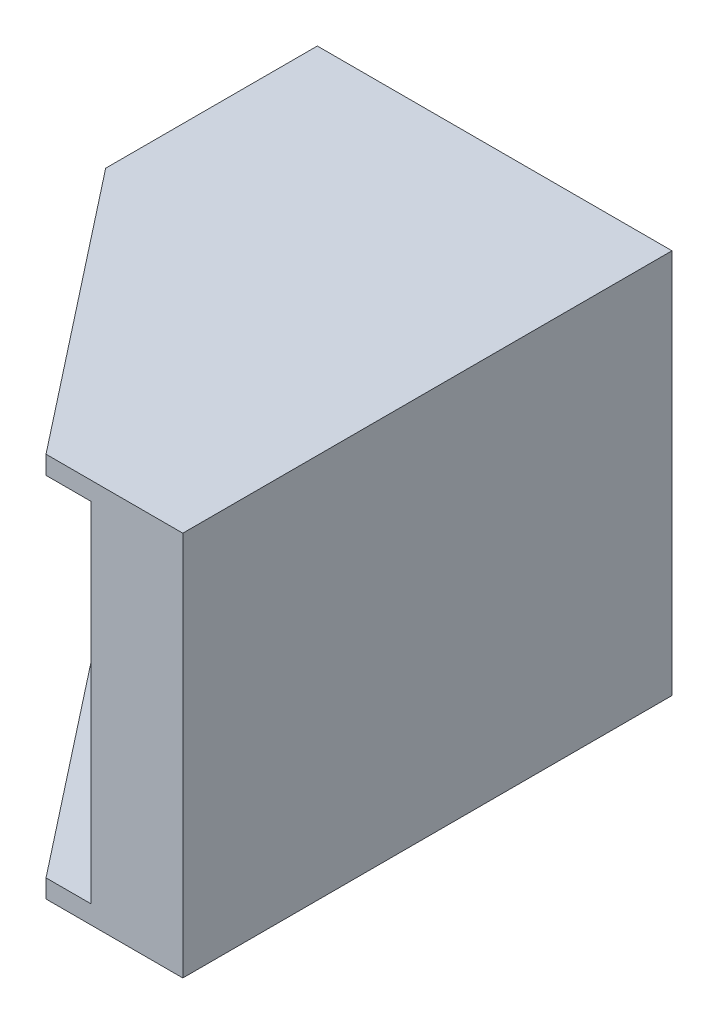
ISO-10303-21;
HEADER;
FILE_DESCRIPTION(('STEP AP214'),'2;1');
FILE_NAME('part.step','',(''),(''),'','','');
FILE_SCHEMA(('AUTOMOTIVE_DESIGN { 1 0 10303 214 1 1 1 1 }'));
ENDSEC;
DATA;
#1=APPLICATION_CONTEXT('core data for automotive mechanical design processes');
#2=APPLICATION_PROTOCOL_DEFINITION('international standard','automotive_design',2000,#1);
#3=PRODUCT_CONTEXT('',#1,'mechanical');
#4=PRODUCT('Part','Part','',(#3));
#5=PRODUCT_RELATED_PRODUCT_CATEGORY('part','',(#4));
#6=PRODUCT_DEFINITION_FORMATION('','',#4);
#7=PRODUCT_DEFINITION_CONTEXT('part definition',#1,'design');
#8=PRODUCT_DEFINITION('design','',#6,#7);
#9=PRODUCT_DEFINITION_SHAPE('','',#8);
#10=(LENGTH_UNIT() NAMED_UNIT(*) SI_UNIT(.MILLI.,.METRE.));
#11=(NAMED_UNIT(*) PLANE_ANGLE_UNIT() SI_UNIT($,.RADIAN.));
#12=(NAMED_UNIT(*) SI_UNIT($,.STERADIAN.) SOLID_ANGLE_UNIT());
#13=UNCERTAINTY_MEASURE_WITH_UNIT(LENGTH_MEASURE(1.E-05),#10,'distance_accuracy_value','');
#14=(GEOMETRIC_REPRESENTATION_CONTEXT(3) GLOBAL_UNCERTAINTY_ASSIGNED_CONTEXT((#13)) GLOBAL_UNIT_ASSIGNED_CONTEXT((#10,
#11,#12)) REPRESENTATION_CONTEXT('',''));
#15=CARTESIAN_POINT('',(0.,0.,0.));
#16=DIRECTION('',(0.,0.,1.));
#17=DIRECTION('',(1.,0.,0.));
#18=AXIS2_PLACEMENT_3D('',#15,#16,#17);
#19=CARTESIAN_POINT('',(-63.8521253201691,33.0849783461479,60.));
#20=DIRECTION('',(1.,0.,0.));
#21=DIRECTION('',(0.,0.,-1.));
#22=AXIS2_PLACEMENT_3D('',#19,#20,#21);
#23=PLANE('',#22);
#24=DIRECTION('',(0.,0.,-1.));
#25=VECTOR('',#24,1.);
#26=CARTESIAN_POINT('',(-63.8521253201691,-29.9150216538521,60.));
#27=LINE('',#26,#25);
#28=CARTESIAN_POINT('',(-63.8521253201691,-29.9150216538521,14.6149110205421));
#29=VERTEX_POINT('',#28);
#30=CARTESIAN_POINT('',(-63.8521253201691,-29.9150216538521,-20.));
#31=VERTEX_POINT('',#30);
#32=EDGE_CURVE('E51',#29,#31,#27,.T.);
#33=ORIENTED_EDGE('',*,*,#32,.F.);
#34=DIRECTION('',(0.,-1.,0.));
#35=VECTOR('',#34,1.);
#36=CARTESIAN_POINT('',(-63.8521253201691,33.0849783461479,14.6149110205421));
#37=LINE('',#36,#35);
#38=CARTESIAN_POINT('',(-63.8521253201691,-26.9150216538521,14.6149110205421));
#39=VERTEX_POINT('',#38);
#40=EDGE_CURVE('E159',#39,#29,#37,.T.);
#41=ORIENTED_EDGE('',*,*,#40,.F.);
#42=DIRECTION('',(0.,0.,1.));
#43=VECTOR('',#42,1.);
#44=CARTESIAN_POINT('',(-63.8521253201691,-26.9150216538521,4.00000000000003));
#45=LINE('',#44,#43);
#46=CARTESIAN_POINT('',(-63.8521253201691,-26.9150216538521,4.00000000000003));
#47=VERTEX_POINT('',#46);
#48=EDGE_CURVE('E189',#47,#39,#45,.T.);
#49=ORIENTED_EDGE('',*,*,#48,.F.);
#50=DIRECTION('',(0.,-1.,0.));
#51=VECTOR('',#50,1.);
#52=CARTESIAN_POINT('',(-63.8521253201691,30.0849783461479,4.00000000000003));
#53=LINE('',#52,#51);
#54=CARTESIAN_POINT('',(-63.8521253201691,30.0849783461479,4.00000000000003));
#55=VERTEX_POINT('',#54);
#56=EDGE_CURVE('E172',#55,#47,#53,.T.);
#57=ORIENTED_EDGE('',*,*,#56,.F.);
#58=DIRECTION('',(0.,0.,1.));
#59=VECTOR('',#58,1.);
#60=CARTESIAN_POINT('',(-63.8521253201691,30.0849783461479,4.00000000000003));
#61=LINE('',#60,#59);
#62=CARTESIAN_POINT('',(-63.8521253201691,30.0849783461479,14.6149110205421));
#63=VERTEX_POINT('',#62);
#64=EDGE_CURVE('E199',#55,#63,#61,.T.);
#65=ORIENTED_EDGE('',*,*,#64,.T.);
#66=CARTESIAN_POINT('',(-63.8521253201691,33.0849783461479,14.6149110205421));
#67=VERTEX_POINT('',#66);
#68=EDGE_CURVE('E58',#67,#63,#37,.T.);
#69=ORIENTED_EDGE('',*,*,#68,.F.);
#70=DIRECTION('',(0.,0.,-1.));
#71=VECTOR('',#70,1.);
#72=CARTESIAN_POINT('',(-63.8521253201691,33.0849783461479,60.));
#73=LINE('',#72,#71);
#74=CARTESIAN_POINT('',(-63.8521253201691,33.0849783461479,-20.));
#75=VERTEX_POINT('',#74);
#76=EDGE_CURVE('E222',#67,#75,#73,.T.);
#77=ORIENTED_EDGE('',*,*,#76,.T.);
#78=DIRECTION('',(0.,1.,0.));
#79=VECTOR('',#78,1.);
#80=CARTESIAN_POINT('',(-63.8521253201691,33.0849783461479,-20.));
#81=LINE('',#80,#79);
#82=EDGE_CURVE('E141',#31,#75,#81,.T.);
#83=ORIENTED_EDGE('',*,*,#82,.F.);
#84=EDGE_LOOP('',(#33,#41,#49,#57,#65,#69,#77,#83));
#85=FACE_BOUND('',#84,.T.);
#86=ADVANCED_FACE('F43',(#85),#23,.F.);
#87=CARTESIAN_POINT('',(-63.8521253201691,-29.9150216538521,60.));
#88=DIRECTION('',(0.,1.,0.));
#89=DIRECTION('',(0.,0.,1.));
#90=AXIS2_PLACEMENT_3D('',#87,#88,#89);
#91=PLANE('',#90);
#92=DIRECTION('',(1.,0.,0.));
#93=VECTOR('',#92,1.);
#94=CARTESIAN_POINT('',(-63.8521253201691,-29.9150216538521,60.));
#95=LINE('',#94,#93);
#96=CARTESIAN_POINT('',(-28.2220402774435,-29.9150216538521,60.));
#97=VERTEX_POINT('',#96);
#98=CARTESIAN_POINT('',(-5.85212532016911,-29.9150216538521,60.));
#99=VERTEX_POINT('',#98);
#100=EDGE_CURVE('E203',#97,#99,#95,.T.);
#101=ORIENTED_EDGE('',*,*,#100,.F.);
#102=DIRECTION('',(0.61750402033065,0.,0.786567724277754));
#103=VECTOR('',#102,1.);
#104=CARTESIAN_POINT('',(-63.8521253201691,-29.9150216538521,14.6149110205421));
#105=LINE('',#104,#103);
#106=EDGE_CURVE('E154',#29,#97,#105,.T.);
#107=ORIENTED_EDGE('',*,*,#106,.F.);
#108=ORIENTED_EDGE('',*,*,#32,.T.);
#109=DIRECTION('',(-1.,0.,0.));
#110=VECTOR('',#109,1.);
#111=CARTESIAN_POINT('',(-5.85212532016911,-29.9150216538521,-20.));
#112=LINE('',#111,#110);
#113=CARTESIAN_POINT('',(-5.85212532016911,-29.9150216538521,-20.));
#114=VERTEX_POINT('',#113);
#115=EDGE_CURVE('E133',#114,#31,#112,.T.);
#116=ORIENTED_EDGE('',*,*,#115,.F.);
#117=DIRECTION('',(0.,0.,-1.));
#118=VECTOR('',#117,1.);
#119=CARTESIAN_POINT('',(-5.85212532016911,-29.9150216538521,60.));
#120=LINE('',#119,#118);
#121=EDGE_CURVE('E120',#99,#114,#120,.T.);
#122=ORIENTED_EDGE('',*,*,#121,.F.);
#123=EDGE_LOOP('',(#101,#107,#108,#116,#122));
#124=FACE_BOUND('',#123,.T.);
#125=ADVANCED_FACE('F134',(#124),#91,.F.);
#126=CARTESIAN_POINT('',(-5.85212532016911,33.0849783461479,60.));
#127=DIRECTION('',(-1.,0.,0.));
#128=DIRECTION('',(0.,-1.,0.));
#129=AXIS2_PLACEMENT_3D('',#126,#127,#128);
#130=PLANE('',#129);
#131=ORIENTED_EDGE('',*,*,#121,.T.);
#132=DIRECTION('',(0.,-1.,0.));
#133=VECTOR('',#132,1.);
#134=CARTESIAN_POINT('',(-5.85212532016911,33.0849783461479,-20.));
#135=LINE('',#134,#133);
#136=CARTESIAN_POINT('',(-5.85212532016911,33.0849783461479,-20.));
#137=VERTEX_POINT('',#136);
#138=EDGE_CURVE('E125',#137,#114,#135,.T.);
#139=ORIENTED_EDGE('',*,*,#138,.F.);
#140=DIRECTION('',(0.,0.,-1.));
#141=VECTOR('',#140,1.);
#142=CARTESIAN_POINT('',(-5.85212532016911,33.0849783461479,60.));
#143=LINE('',#142,#141);
#144=CARTESIAN_POINT('',(-5.85212532016911,33.0849783461479,60.));
#145=VERTEX_POINT('',#144);
#146=EDGE_CURVE('E130',#145,#137,#143,.T.);
#147=ORIENTED_EDGE('',*,*,#146,.F.);
#148=DIRECTION('',(0.,1.,0.));
#149=VECTOR('',#148,1.);
#150=CARTESIAN_POINT('',(-5.85212532016911,33.0849783461479,60.));
#151=LINE('',#150,#149);
#152=EDGE_CURVE('E126',#99,#145,#151,.T.);
#153=ORIENTED_EDGE('',*,*,#152,.F.);
#154=EDGE_LOOP('',(#131,#139,#147,#153));
#155=FACE_BOUND('',#154,.T.);
#156=ADVANCED_FACE('F122',(#155),#130,.F.);
#157=CARTESIAN_POINT('',(-63.8521253201691,33.0849783461479,60.));
#158=DIRECTION('',(0.,-1.,0.));
#159=DIRECTION('',(0.,0.,-1.));
#160=AXIS2_PLACEMENT_3D('',#157,#158,#159);
#161=PLANE('',#160);
#162=ORIENTED_EDGE('',*,*,#76,.F.);
#163=DIRECTION('',(0.61750402033065,0.,0.786567724277754));
#164=VECTOR('',#163,1.);
#165=CARTESIAN_POINT('',(-63.8521253201691,33.0849783461479,14.6149110205421));
#166=LINE('',#165,#164);
#167=CARTESIAN_POINT('',(-28.2220402774435,33.0849783461479,60.));
#168=VERTEX_POINT('',#167);
#169=EDGE_CURVE('E155',#67,#168,#166,.T.);
#170=ORIENTED_EDGE('',*,*,#169,.T.);
#171=DIRECTION('',(-1.,0.,0.));
#172=VECTOR('',#171,1.);
#173=CARTESIAN_POINT('',(-63.8521253201691,33.0849783461479,60.));
#174=LINE('',#173,#172);
#175=EDGE_CURVE('E218',#145,#168,#174,.T.);
#176=ORIENTED_EDGE('',*,*,#175,.F.);
#177=ORIENTED_EDGE('',*,*,#146,.T.);
#178=DIRECTION('',(1.,0.,0.));
#179=VECTOR('',#178,1.);
#180=CARTESIAN_POINT('',(-5.85212532016911,33.0849783461479,-20.));
#181=LINE('',#180,#179);
#182=EDGE_CURVE('E146',#75,#137,#181,.T.);
#183=ORIENTED_EDGE('',*,*,#182,.F.);
#184=EDGE_LOOP('',(#162,#170,#176,#177,#183));
#185=FACE_BOUND('',#184,.T.);
#186=ADVANCED_FACE('F235',(#185),#161,.F.);
#187=CARTESIAN_POINT('',(0.,0.,60.));
#188=DIRECTION('',(0.,0.,1.));
#189=DIRECTION('',(1.,0.,0.));
#190=AXIS2_PLACEMENT_3D('',#187,#188,#189);
#191=PLANE('',#190);
#192=DIRECTION('',(0.,-1.,0.));
#193=VECTOR('',#192,1.);
#194=CARTESIAN_POINT('',(-28.2220402774435,33.0849783461479,60.));
#195=LINE('',#194,#193);
#196=CARTESIAN_POINT('',(-28.2220402774435,-26.9150216538521,60.));
#197=VERTEX_POINT('',#196);
#198=EDGE_CURVE('E66',#197,#97,#195,.T.);
#199=ORIENTED_EDGE('',*,*,#198,.T.);
#200=ORIENTED_EDGE('',*,*,#100,.T.);
#201=ORIENTED_EDGE('',*,*,#152,.T.);
#202=ORIENTED_EDGE('',*,*,#175,.T.);
#203=CARTESIAN_POINT('',(-28.2220402774435,30.0849783461479,60.));
#204=VERTEX_POINT('',#203);
#205=EDGE_CURVE('E162',#168,#204,#195,.T.);
#206=ORIENTED_EDGE('',*,*,#205,.T.);
#207=DIRECTION('',(-1.,0.,0.));
#208=VECTOR('',#207,1.);
#209=CARTESIAN_POINT('',(-63.8521253201691,30.0849783461479,60.));
#210=LINE('',#209,#208);
#211=CARTESIAN_POINT('',(-20.8521253201691,30.0849783461479,60.));
#212=VERTEX_POINT('',#211);
#213=EDGE_CURVE('E177',#212,#204,#210,.T.);
#214=ORIENTED_EDGE('',*,*,#213,.F.);
#215=DIRECTION('',(0.,1.,0.));
#216=VECTOR('',#215,1.);
#217=CARTESIAN_POINT('',(-20.8521253201691,30.0849783461479,60.));
#218=LINE('',#217,#216);
#219=CARTESIAN_POINT('',(-20.8521253201691,-26.9150216538521,60.));
#220=VERTEX_POINT('',#219);
#221=EDGE_CURVE('E192',#220,#212,#218,.T.);
#222=ORIENTED_EDGE('',*,*,#221,.F.);
#223=DIRECTION('',(1.,0.,0.));
#224=VECTOR('',#223,1.);
#225=CARTESIAN_POINT('',(-63.8521253201691,-26.9150216538521,60.));
#226=LINE('',#225,#224);
#227=EDGE_CURVE('E171',#197,#220,#226,.T.);
#228=ORIENTED_EDGE('',*,*,#227,.F.);
#229=EDGE_LOOP('',(#199,#200,#201,#202,#206,#214,#222,#228));
#230=FACE_BOUND('',#229,.T.);
#231=ADVANCED_FACE('F238',(#230),#191,.T.);
#232=CARTESIAN_POINT('',(-63.8521253201691,30.0849783461479,4.00000000000003));
#233=DIRECTION('',(0.,1.,0.));
#234=DIRECTION('',(0.,0.,1.));
#235=AXIS2_PLACEMENT_3D('',#232,#233,#234);
#236=PLANE('',#235);
#237=ORIENTED_EDGE('',*,*,#213,.T.);
#238=DIRECTION('',(-0.61750402033065,0.,-0.786567724277754));
#239=VECTOR('',#238,1.);
#240=CARTESIAN_POINT('',(-69.0078802922902,30.0849783461479,8.04758461968156));
#241=LINE('',#240,#239);
#242=EDGE_CURVE('E166',#204,#63,#241,.T.);
#243=ORIENTED_EDGE('',*,*,#242,.T.);
#244=ORIENTED_EDGE('',*,*,#64,.F.);
#245=DIRECTION('',(-1.,0.,0.));
#246=VECTOR('',#245,1.);
#247=CARTESIAN_POINT('',(-63.8521253201691,30.0849783461479,4.00000000000003));
#248=LINE('',#247,#246);
#249=CARTESIAN_POINT('',(-20.8521253201691,30.0849783461479,4.00000000000003));
#250=VERTEX_POINT('',#249);
#251=EDGE_CURVE('E185',#250,#55,#248,.T.);
#252=ORIENTED_EDGE('',*,*,#251,.F.);
#253=DIRECTION('',(0.,0.,1.));
#254=VECTOR('',#253,1.);
#255=CARTESIAN_POINT('',(-20.8521253201691,30.0849783461479,4.00000000000003));
#256=LINE('',#255,#254);
#257=EDGE_CURVE('E204',#250,#212,#256,.T.);
#258=ORIENTED_EDGE('',*,*,#257,.T.);
#259=EDGE_LOOP('',(#237,#243,#244,#252,#258));
#260=FACE_BOUND('',#259,.T.);
#261=ADVANCED_FACE('F252',(#260),#236,.F.);
#262=CARTESIAN_POINT('',(-20.8521253201691,30.0849783461479,4.00000000000003));
#263=DIRECTION('',(1.,0.,0.));
#264=DIRECTION('',(0.,0.,-1.));
#265=AXIS2_PLACEMENT_3D('',#262,#263,#264);
#266=PLANE('',#265);
#267=ORIENTED_EDGE('',*,*,#221,.T.);
#268=ORIENTED_EDGE('',*,*,#257,.F.);
#269=DIRECTION('',(0.,1.,0.));
#270=VECTOR('',#269,1.);
#271=CARTESIAN_POINT('',(-20.8521253201691,30.0849783461479,4.00000000000003));
#272=LINE('',#271,#270);
#273=CARTESIAN_POINT('',(-20.8521253201691,-26.9150216538521,4.00000000000003));
#274=VERTEX_POINT('',#273);
#275=EDGE_CURVE('E181',#274,#250,#272,.T.);
#276=ORIENTED_EDGE('',*,*,#275,.F.);
#277=DIRECTION('',(0.,0.,1.));
#278=VECTOR('',#277,1.);
#279=CARTESIAN_POINT('',(-20.8521253201691,-26.9150216538521,4.00000000000003));
#280=LINE('',#279,#278);
#281=EDGE_CURVE('E207',#274,#220,#280,.T.);
#282=ORIENTED_EDGE('',*,*,#281,.T.);
#283=EDGE_LOOP('',(#267,#268,#276,#282));
#284=FACE_BOUND('',#283,.T.);
#285=ADVANCED_FACE('F246',(#284),#266,.F.);
#286=CARTESIAN_POINT('',(-63.8521253201691,-26.9150216538521,4.00000000000003));
#287=DIRECTION('',(0.,-1.,0.));
#288=DIRECTION('',(0.,0.,-1.));
#289=AXIS2_PLACEMENT_3D('',#286,#287,#288);
#290=PLANE('',#289);
#291=ORIENTED_EDGE('',*,*,#48,.T.);
#292=DIRECTION('',(0.61750402033065,0.,0.786567724277754));
#293=VECTOR('',#292,1.);
#294=CARTESIAN_POINT('',(-69.0078802922902,-26.9150216538521,8.04758461968156));
#295=LINE('',#294,#293);
#296=EDGE_CURVE('E11',#39,#197,#295,.T.);
#297=ORIENTED_EDGE('',*,*,#296,.T.);
#298=ORIENTED_EDGE('',*,*,#227,.T.);
#299=ORIENTED_EDGE('',*,*,#281,.F.);
#300=DIRECTION('',(1.,0.,0.));
#301=VECTOR('',#300,1.);
#302=CARTESIAN_POINT('',(-63.8521253201691,-26.9150216538521,4.00000000000003));
#303=LINE('',#302,#301);
#304=EDGE_CURVE('E176',#47,#274,#303,.T.);
#305=ORIENTED_EDGE('',*,*,#304,.F.);
#306=EDGE_LOOP('',(#291,#297,#298,#299,#305));
#307=FACE_BOUND('',#306,.T.);
#308=ADVANCED_FACE('F243',(#307),#290,.F.);
#309=CARTESIAN_POINT('',(0.,0.,4.00000000000003));
#310=DIRECTION('',(0.,0.,1.));
#311=DIRECTION('',(1.,0.,0.));
#312=AXIS2_PLACEMENT_3D('',#309,#310,#311);
#313=PLANE('',#312);
#314=ORIENTED_EDGE('',*,*,#56,.T.);
#315=ORIENTED_EDGE('',*,*,#304,.T.);
#316=ORIENTED_EDGE('',*,*,#275,.T.);
#317=ORIENTED_EDGE('',*,*,#251,.T.);
#318=EDGE_LOOP('',(#314,#315,#316,#317));
#319=FACE_BOUND('',#318,.T.);
#320=ADVANCED_FACE('F249',(#319),#313,.T.);
#321=CARTESIAN_POINT('',(-63.8521253201691,33.0849783461479,14.6149110205421));
#322=DIRECTION('',(0.786567724277754,0.,-0.61750402033065));
#323=DIRECTION('',(-0.61750402033065,0.,-0.786567724277754));
#324=AXIS2_PLACEMENT_3D('',#321,#322,#323);
#325=PLANE('',#324);
#326=ORIENTED_EDGE('',*,*,#40,.T.);
#327=ORIENTED_EDGE('',*,*,#106,.T.);
#328=ORIENTED_EDGE('',*,*,#198,.F.);
#329=ORIENTED_EDGE('',*,*,#296,.F.);
#330=EDGE_LOOP('',(#326,#327,#328,#329));
#331=FACE_BOUND('',#330,.T.);
#332=ADVANCED_FACE('F230',(#331),#325,.F.);
#333=ORIENTED_EDGE('',*,*,#205,.F.);
#334=ORIENTED_EDGE('',*,*,#169,.F.);
#335=ORIENTED_EDGE('',*,*,#68,.T.);
#336=ORIENTED_EDGE('',*,*,#242,.F.);
#337=EDGE_LOOP('',(#333,#334,#335,#336));
#338=FACE_BOUND('',#337,.T.);
#339=ADVANCED_FACE('F253',(#338),#325,.F.);
#340=CARTESIAN_POINT('',(0.,0.,-20.));
#341=DIRECTION('',(0.,0.,-1.));
#342=DIRECTION('',(-1.,0.,0.));
#343=AXIS2_PLACEMENT_3D('',#340,#341,#342);
#344=PLANE('',#343);
#345=ORIENTED_EDGE('',*,*,#138,.T.);
#346=ORIENTED_EDGE('',*,*,#115,.T.);
#347=ORIENTED_EDGE('',*,*,#82,.T.);
#348=ORIENTED_EDGE('',*,*,#182,.T.);
#349=EDGE_LOOP('',(#345,#346,#347,#348));
#350=FACE_BOUND('',#349,.T.);
#351=ADVANCED_FACE('F144',(#350),#344,.T.);
#352=CLOSED_SHELL('',(#86,#125,#156,#186,#231,#261,#285,#308,#320,#332,#339,#351));
#353=MANIFOLD_SOLID_BREP('B2',#352);
#354=ADVANCED_BREP_SHAPE_REPRESENTATION('',(#18,#353),#14);
#355=SHAPE_DEFINITION_REPRESENTATION(#9,#354);
ENDSEC;
END-ISO-10303-21;
